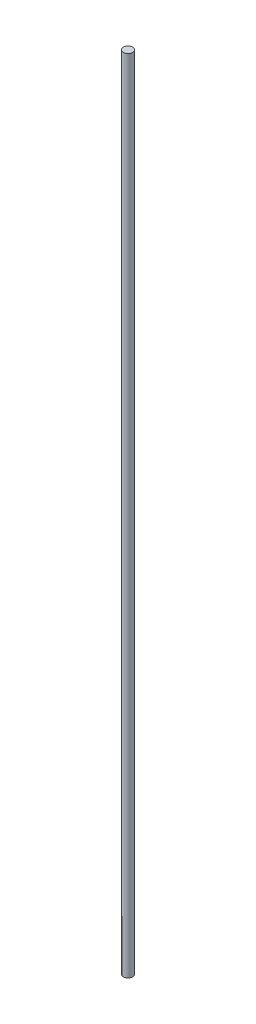
ISO-10303-21;
HEADER;
FILE_DESCRIPTION(('STEP AP214'),'2;1');
FILE_NAME('part.step','',(''),(''),'','','');
FILE_SCHEMA(('AUTOMOTIVE_DESIGN { 1 0 10303 214 1 1 1 1 }'));
ENDSEC;
DATA;
#1=APPLICATION_CONTEXT('core data for automotive mechanical design processes');
#2=APPLICATION_PROTOCOL_DEFINITION('international standard','automotive_design',2000,#1);
#3=PRODUCT_CONTEXT('',#1,'mechanical');
#4=PRODUCT('Part','Part','',(#3));
#5=PRODUCT_RELATED_PRODUCT_CATEGORY('part','',(#4));
#6=PRODUCT_DEFINITION_FORMATION('','',#4);
#7=PRODUCT_DEFINITION_CONTEXT('part definition',#1,'design');
#8=PRODUCT_DEFINITION('design','',#6,#7);
#9=PRODUCT_DEFINITION_SHAPE('','',#8);
#10=(LENGTH_UNIT() NAMED_UNIT(*) SI_UNIT(.MILLI.,.METRE.));
#11=(NAMED_UNIT(*) PLANE_ANGLE_UNIT() SI_UNIT($,.RADIAN.));
#12=(NAMED_UNIT(*) SI_UNIT($,.STERADIAN.) SOLID_ANGLE_UNIT());
#13=UNCERTAINTY_MEASURE_WITH_UNIT(LENGTH_MEASURE(1.E-05),#10,'distance_accuracy_value','');
#14=(GEOMETRIC_REPRESENTATION_CONTEXT(3) GLOBAL_UNCERTAINTY_ASSIGNED_CONTEXT((#13)) GLOBAL_UNIT_ASSIGNED_CONTEXT((#10,
#11,#12)) REPRESENTATION_CONTEXT('',''));
#15=CARTESIAN_POINT('',(0.,0.,0.));
#16=DIRECTION('',(0.,0.,1.));
#17=DIRECTION('',(1.,0.,0.));
#18=AXIS2_PLACEMENT_3D('',#15,#16,#17);
#19=CARTESIAN_POINT('',(0.,0.,0.));
#20=DIRECTION('',(0.,-1.,0.));
#21=DIRECTION('',(0.,0.,-1.));
#22=AXIS2_PLACEMENT_3D('',#19,#20,#21);
#23=PLANE('',#22);
#24=CARTESIAN_POINT('',(0.,0.,0.));
#25=DIRECTION('',(0.,-1.,0.));
#26=DIRECTION('',(0.,0.,-1.));
#27=AXIS2_PLACEMENT_3D('',#24,#25,#26);
#28=CIRCLE('',#27,3.175);
#29=CARTESIAN_POINT('',(0.,0.,-3.175));
#30=VERTEX_POINT('',#29);
#31=EDGE_CURVE('E10',#30,#30,#28,.T.);
#32=ORIENTED_EDGE('',*,*,#31,.F.);
#33=EDGE_LOOP('',(#32));
#34=FACE_BOUND('',#33,.T.);
#35=ADVANCED_FACE('F34',(#34),#23,.F.);
#36=CARTESIAN_POINT('',(0.,-542.925,0.));
#37=DIRECTION('',(0.,-1.,0.));
#38=DIRECTION('',(0.,0.,-1.));
#39=AXIS2_PLACEMENT_3D('',#36,#37,#38);
#40=CYLINDRICAL_SURFACE('',#39,3.17499999999996);
#41=CARTESIAN_POINT('',(0.,-552.45,0.));
#42=DIRECTION('',(0.,-1.,0.));
#43=DIRECTION('',(0.,0.,-1.));
#44=AXIS2_PLACEMENT_3D('',#41,#42,#43);
#45=CIRCLE('',#44,3.17499999999993);
#46=CARTESIAN_POINT('',(0.,-552.45,-3.17499999999993));
#47=VERTEX_POINT('',#46);
#48=EDGE_CURVE('E40',#47,#47,#45,.T.);
#49=ORIENTED_EDGE('',*,*,#48,.F.);
#50=EDGE_LOOP('',(#49));
#51=FACE_BOUND('',#50,.T.);
#52=ORIENTED_EDGE('',*,*,#31,.T.);
#53=EDGE_LOOP('',(#52));
#54=FACE_BOUND('',#53,.T.);
#55=ADVANCED_FACE('F64',(#51,#54),#40,.T.);
#56=CARTESIAN_POINT('',(-3.17499999999993,-552.45,0.));
#57=DIRECTION('',(0.,1.,0.));
#58=DIRECTION('',(0.,0.,1.));
#59=AXIS2_PLACEMENT_3D('',#56,#57,#58);
#60=PLANE('',#59);
#61=CARTESIAN_POINT('',(0.,-552.45,0.));
#62=DIRECTION('',(0.,-1.,0.));
#63=DIRECTION('',(0.,0.,-1.));
#64=AXIS2_PLACEMENT_3D('',#61,#62,#63);
#65=CIRCLE('',#64,1.5875);
#66=CARTESIAN_POINT('',(0.,-552.45,-1.5875));
#67=VERTEX_POINT('',#66);
#68=EDGE_CURVE('E44',#67,#67,#65,.T.);
#69=ORIENTED_EDGE('',*,*,#68,.F.);
#70=EDGE_LOOP('',(#69));
#71=FACE_BOUND('',#70,.T.);
#72=ORIENTED_EDGE('',*,*,#48,.T.);
#73=EDGE_LOOP('',(#72));
#74=FACE_BOUND('',#73,.T.);
#75=ADVANCED_FACE('F59',(#71,#74),#60,.F.);
#76=CARTESIAN_POINT('',(0.,-542.925,0.));
#77=DIRECTION('',(0.,-1.,0.));
#78=DIRECTION('',(0.,0.,-1.));
#79=AXIS2_PLACEMENT_3D('',#76,#77,#78);
#80=CYLINDRICAL_SURFACE('',#79,1.5875);
#81=CARTESIAN_POINT('',(0.,-542.925,0.));
#82=DIRECTION('',(0.,-1.,0.));
#83=DIRECTION('',(0.,0.,-1.));
#84=AXIS2_PLACEMENT_3D('',#81,#82,#83);
#85=CIRCLE('',#84,1.5875);
#86=CARTESIAN_POINT('',(0.,-542.925,-1.5875));
#87=VERTEX_POINT('',#86);
#88=EDGE_CURVE('E48',#87,#87,#85,.T.);
#89=ORIENTED_EDGE('',*,*,#88,.F.);
#90=EDGE_LOOP('',(#89));
#91=FACE_BOUND('',#90,.T.);
#92=ORIENTED_EDGE('',*,*,#68,.T.);
#93=EDGE_LOOP('',(#92));
#94=FACE_BOUND('',#93,.T.);
#95=ADVANCED_FACE('F56',(#91,#94),#80,.F.);
#96=CARTESIAN_POINT('',(-1.5875,-542.925,0.));
#97=DIRECTION('',(0.,1.,0.));
#98=DIRECTION('',(0.,0.,1.));
#99=AXIS2_PLACEMENT_3D('',#96,#97,#98);
#100=PLANE('',#99);
#101=ORIENTED_EDGE('',*,*,#88,.T.);
#102=EDGE_LOOP('',(#101));
#103=FACE_BOUND('',#102,.T.);
#104=ADVANCED_FACE('F54',(#103),#100,.F.);
#105=CLOSED_SHELL('',(#35,#55,#75,#95,#104));
#106=MANIFOLD_SOLID_BREP('B2',#105);
#107=ADVANCED_BREP_SHAPE_REPRESENTATION('',(#18,#106),#14);
#108=SHAPE_DEFINITION_REPRESENTATION(#9,#107);
ENDSEC;
END-ISO-10303-21;
